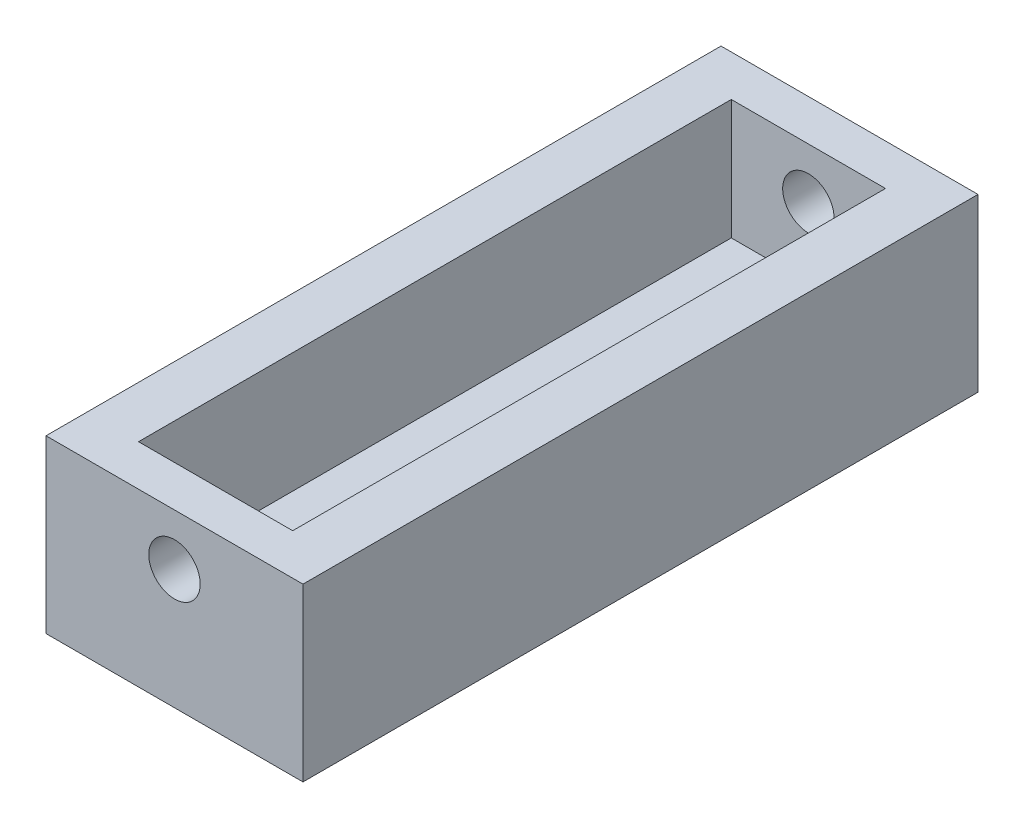
ISO-10303-21;
HEADER;
FILE_DESCRIPTION(('STEP AP214'),'2;1');
FILE_NAME('part.step','',(''),(''),'','','');
FILE_SCHEMA(('AUTOMOTIVE_DESIGN { 1 0 10303 214 1 1 1 1 }'));
ENDSEC;
DATA;
#1=APPLICATION_CONTEXT('core data for automotive mechanical design processes');
#2=APPLICATION_PROTOCOL_DEFINITION('international standard','automotive_design',2000,#1);
#3=PRODUCT_CONTEXT('',#1,'mechanical');
#4=PRODUCT('Part','Part','',(#3));
#5=PRODUCT_RELATED_PRODUCT_CATEGORY('part','',(#4));
#6=PRODUCT_DEFINITION_FORMATION('','',#4);
#7=PRODUCT_DEFINITION_CONTEXT('part definition',#1,'design');
#8=PRODUCT_DEFINITION('design','',#6,#7);
#9=PRODUCT_DEFINITION_SHAPE('','',#8);
#10=(LENGTH_UNIT() NAMED_UNIT(*) SI_UNIT(.MILLI.,.METRE.));
#11=(NAMED_UNIT(*) PLANE_ANGLE_UNIT() SI_UNIT($,.RADIAN.));
#12=(NAMED_UNIT(*) SI_UNIT($,.STERADIAN.) SOLID_ANGLE_UNIT());
#13=UNCERTAINTY_MEASURE_WITH_UNIT(LENGTH_MEASURE(1.E-05),#10,'distance_accuracy_value','');
#14=(GEOMETRIC_REPRESENTATION_CONTEXT(3) GLOBAL_UNCERTAINTY_ASSIGNED_CONTEXT((#13)) GLOBAL_UNIT_ASSIGNED_CONTEXT((#10,
#11,#12)) REPRESENTATION_CONTEXT('',''));
#15=CARTESIAN_POINT('',(0.,0.,0.));
#16=DIRECTION('',(0.,0.,1.));
#17=DIRECTION('',(1.,0.,0.));
#18=AXIS2_PLACEMENT_3D('',#15,#16,#17);
#19=CARTESIAN_POINT('',(0.,0.,0.));
#20=DIRECTION('',(0.,0.,1.));
#21=DIRECTION('',(1.,0.,0.));
#22=AXIS2_PLACEMENT_3D('',#19,#20,#21);
#23=PLANE('',#22);
#24=CARTESIAN_POINT('',(0.,3.5,0.));
#25=DIRECTION('',(0.,0.,1.));
#26=DIRECTION('',(1.,0.,0.));
#27=AXIS2_PLACEMENT_3D('',#24,#25,#26);
#28=CIRCLE('',#27,0.75);
#29=CARTESIAN_POINT('',(0.75,3.5,0.));
#30=VERTEX_POINT('',#29);
#31=EDGE_CURVE('E170',#30,#30,#28,.T.);
#32=ORIENTED_EDGE('',*,*,#31,.F.);
#33=EDGE_LOOP('',(#32));
#34=FACE_BOUND('',#33,.T.);
#35=DIRECTION('',(-1.,0.,0.));
#36=VECTOR('',#35,1.);
#37=CARTESIAN_POINT('',(-2.25,1.5,0.));
#38=LINE('',#37,#36);
#39=CARTESIAN_POINT('',(-0.6,1.5,0.));
#40=VERTEX_POINT('',#39);
#41=CARTESIAN_POINT('',(-2.25,1.5,0.));
#42=VERTEX_POINT('',#41);
#43=EDGE_CURVE('E190',#40,#42,#38,.T.);
#44=ORIENTED_EDGE('',*,*,#43,.F.);
#45=DIRECTION('',(0.,1.,0.));
#46=VECTOR('',#45,1.);
#47=CARTESIAN_POINT('',(-0.6,1.5,0.));
#48=LINE('',#47,#46);
#49=CARTESIAN_POINT('',(-0.6,0.,0.));
#50=VERTEX_POINT('',#49);
#51=EDGE_CURVE('E175',#50,#40,#48,.T.);
#52=ORIENTED_EDGE('',*,*,#51,.F.);
#53=DIRECTION('',(-1.,0.,0.));
#54=VECTOR('',#53,1.);
#55=CARTESIAN_POINT('',(0.,0.,0.));
#56=LINE('',#55,#54);
#57=CARTESIAN_POINT('',(0.6,0.,0.));
#58=VERTEX_POINT('',#57);
#59=EDGE_CURVE('E203',#58,#50,#56,.T.);
#60=ORIENTED_EDGE('',*,*,#59,.F.);
#61=DIRECTION('',(0.,-1.,0.));
#62=VECTOR('',#61,1.);
#63=CARTESIAN_POINT('',(0.6,1.5,0.));
#64=LINE('',#63,#62);
#65=CARTESIAN_POINT('',(0.6,1.5,0.));
#66=VERTEX_POINT('',#65);
#67=EDGE_CURVE('E222',#66,#58,#64,.T.);
#68=ORIENTED_EDGE('',*,*,#67,.F.);
#69=DIRECTION('',(-1.,0.,0.));
#70=VECTOR('',#69,1.);
#71=CARTESIAN_POINT('',(2.25,1.5,0.));
#72=LINE('',#71,#70);
#73=CARTESIAN_POINT('',(2.25,1.5,0.));
#74=VERTEX_POINT('',#73);
#75=EDGE_CURVE('E227',#74,#66,#72,.T.);
#76=ORIENTED_EDGE('',*,*,#75,.F.);
#77=DIRECTION('',(0.,-1.,0.));
#78=VECTOR('',#77,1.);
#79=CARTESIAN_POINT('',(2.25,5.,0.));
#80=LINE('',#79,#78);
#81=CARTESIAN_POINT('',(2.25,5.,0.));
#82=VERTEX_POINT('',#81);
#83=EDGE_CURVE('E230',#82,#74,#80,.T.);
#84=ORIENTED_EDGE('',*,*,#83,.F.);
#85=DIRECTION('',(1.,0.,0.));
#86=VECTOR('',#85,1.);
#87=CARTESIAN_POINT('',(0.,5.,0.));
#88=LINE('',#87,#86);
#89=CARTESIAN_POINT('',(-2.25,5.,0.));
#90=VERTEX_POINT('',#89);
#91=EDGE_CURVE('E54',#90,#82,#88,.T.);
#92=ORIENTED_EDGE('',*,*,#91,.F.);
#93=DIRECTION('',(0.,1.,0.));
#94=VECTOR('',#93,1.);
#95=CARTESIAN_POINT('',(-2.25,1.5,0.));
#96=LINE('',#95,#94);
#97=EDGE_CURVE('E182',#42,#90,#96,.T.);
#98=ORIENTED_EDGE('',*,*,#97,.F.);
#99=EDGE_LOOP('',(#44,#52,#60,#68,#76,#84,#92,#98));
#100=FACE_BOUND('',#99,.T.);
#101=ADVANCED_FACE('F50',(#34,#100),#23,.T.);
#102=CARTESIAN_POINT('',(0.6,0.,17.3));
#103=DIRECTION('',(0.,1.,0.));
#104=DIRECTION('',(0.,0.,1.));
#105=AXIS2_PLACEMENT_3D('',#102,#103,#104);
#106=PLANE('',#105);
#107=DIRECTION('',(0.,0.,-1.));
#108=VECTOR('',#107,1.);
#109=CARTESIAN_POINT('',(3.75,0.,17.3));
#110=LINE('',#109,#108);
#111=CARTESIAN_POINT('',(3.75,0.,18.5));
#112=VERTEX_POINT('',#111);
#113=CARTESIAN_POINT('',(3.75,0.,-1.2));
#114=VERTEX_POINT('',#113);
#115=EDGE_CURVE('E13',#112,#114,#110,.T.);
#116=ORIENTED_EDGE('',*,*,#115,.F.);
#117=DIRECTION('',(1.,0.,0.));
#118=VECTOR('',#117,1.);
#119=CARTESIAN_POINT('',(3.75,0.,18.5));
#120=LINE('',#119,#118);
#121=CARTESIAN_POINT('',(-3.75,0.,18.5));
#122=VERTEX_POINT('',#121);
#123=EDGE_CURVE('E153',#122,#112,#120,.T.);
#124=ORIENTED_EDGE('',*,*,#123,.F.);
#125=DIRECTION('',(0.,0.,1.));
#126=VECTOR('',#125,1.);
#127=CARTESIAN_POINT('',(-3.75,0.,-1.2));
#128=LINE('',#127,#126);
#129=CARTESIAN_POINT('',(-3.75,0.,-1.2));
#130=VERTEX_POINT('',#129);
#131=EDGE_CURVE('E139',#130,#122,#128,.T.);
#132=ORIENTED_EDGE('',*,*,#131,.F.);
#133=DIRECTION('',(-1.,0.,0.));
#134=VECTOR('',#133,1.);
#135=CARTESIAN_POINT('',(0.,0.,-1.2));
#136=LINE('',#135,#134);
#137=EDGE_CURVE('E205',#114,#130,#136,.T.);
#138=ORIENTED_EDGE('',*,*,#137,.F.);
#139=EDGE_LOOP('',(#116,#124,#132,#138));
#140=FACE_BOUND('',#139,.T.);
#141=DIRECTION('',(0.,0.,-1.));
#142=VECTOR('',#141,1.);
#143=CARTESIAN_POINT('',(0.6,0.,17.3));
#144=LINE('',#143,#142);
#145=CARTESIAN_POINT('',(0.6,0.,17.3));
#146=VERTEX_POINT('',#145);
#147=EDGE_CURVE('E69',#146,#58,#144,.T.);
#148=ORIENTED_EDGE('',*,*,#147,.T.);
#149=ORIENTED_EDGE('',*,*,#59,.T.);
#150=DIRECTION('',(0.,0.,-1.));
#151=VECTOR('',#150,1.);
#152=CARTESIAN_POINT('',(-0.6,0.,17.3));
#153=LINE('',#152,#151);
#154=CARTESIAN_POINT('',(-0.6,0.,17.3));
#155=VERTEX_POINT('',#154);
#156=EDGE_CURVE('E201',#155,#50,#153,.T.);
#157=ORIENTED_EDGE('',*,*,#156,.F.);
#158=DIRECTION('',(1.,0.,0.));
#159=VECTOR('',#158,1.);
#160=CARTESIAN_POINT('',(3.75,0.,17.3));
#161=LINE('',#160,#159);
#162=EDGE_CURVE('E167',#155,#146,#161,.T.);
#163=ORIENTED_EDGE('',*,*,#162,.T.);
#164=EDGE_LOOP('',(#148,#149,#157,#163));
#165=FACE_BOUND('',#164,.T.);
#166=ADVANCED_FACE('F52',(#140,#165),#106,.F.);
#167=CARTESIAN_POINT('',(3.75,0.,17.3));
#168=DIRECTION('',(-1.,0.,0.));
#169=DIRECTION('',(0.,0.,1.));
#170=AXIS2_PLACEMENT_3D('',#167,#168,#169);
#171=PLANE('',#170);
#172=ORIENTED_EDGE('',*,*,#115,.T.);
#173=DIRECTION('',(0.,-1.,0.));
#174=VECTOR('',#173,1.);
#175=CARTESIAN_POINT('',(3.75,0.,-1.2));
#176=LINE('',#175,#174);
#177=CARTESIAN_POINT('',(3.75,5.,-1.2));
#178=VERTEX_POINT('',#177);
#179=EDGE_CURVE('E207',#178,#114,#176,.T.);
#180=ORIENTED_EDGE('',*,*,#179,.F.);
#181=DIRECTION('',(0.,0.,-1.));
#182=VECTOR('',#181,1.);
#183=CARTESIAN_POINT('',(3.75,5.,17.3));
#184=LINE('',#183,#182);
#185=CARTESIAN_POINT('',(3.75,5.,18.5));
#186=VERTEX_POINT('',#185);
#187=EDGE_CURVE('E61',#186,#178,#184,.T.);
#188=ORIENTED_EDGE('',*,*,#187,.F.);
#189=DIRECTION('',(0.,1.,0.));
#190=VECTOR('',#189,1.);
#191=CARTESIAN_POINT('',(3.75,5.,18.5));
#192=LINE('',#191,#190);
#193=EDGE_CURVE('E158',#112,#186,#192,.T.);
#194=ORIENTED_EDGE('',*,*,#193,.F.);
#195=EDGE_LOOP('',(#172,#180,#188,#194));
#196=FACE_BOUND('',#195,.T.);
#197=ADVANCED_FACE('F261',(#196),#171,.F.);
#198=CARTESIAN_POINT('',(3.75,5.,17.3));
#199=DIRECTION('',(0.,-1.,0.));
#200=DIRECTION('',(1.,0.,0.));
#201=AXIS2_PLACEMENT_3D('',#198,#199,#200);
#202=PLANE('',#201);
#203=DIRECTION('',(0.,0.,-1.));
#204=VECTOR('',#203,1.);
#205=CARTESIAN_POINT('',(2.25,5.,17.3));
#206=LINE('',#205,#204);
#207=CARTESIAN_POINT('',(2.25,5.,17.3));
#208=VERTEX_POINT('',#207);
#209=EDGE_CURVE('E244',#208,#82,#206,.T.);
#210=ORIENTED_EDGE('',*,*,#209,.F.);
#211=DIRECTION('',(-1.,0.,0.));
#212=VECTOR('',#211,1.);
#213=CARTESIAN_POINT('',(-3.75,5.,17.3));
#214=LINE('',#213,#212);
#215=CARTESIAN_POINT('',(-2.25,5.,17.3));
#216=VERTEX_POINT('',#215);
#217=EDGE_CURVE('E164',#208,#216,#214,.T.);
#218=ORIENTED_EDGE('',*,*,#217,.T.);
#219=DIRECTION('',(0.,0.,-1.));
#220=VECTOR('',#219,1.);
#221=CARTESIAN_POINT('',(-2.25,5.,17.3));
#222=LINE('',#221,#220);
#223=EDGE_CURVE('E188',#216,#90,#222,.T.);
#224=ORIENTED_EDGE('',*,*,#223,.T.);
#225=ORIENTED_EDGE('',*,*,#91,.T.);
#226=EDGE_LOOP('',(#210,#218,#224,#225));
#227=FACE_BOUND('',#226,.T.);
#228=ORIENTED_EDGE('',*,*,#187,.T.);
#229=DIRECTION('',(1.,0.,0.));
#230=VECTOR('',#229,1.);
#231=CARTESIAN_POINT('',(0.,5.,-1.2));
#232=LINE('',#231,#230);
#233=CARTESIAN_POINT('',(-3.75,5.,-1.2));
#234=VERTEX_POINT('',#233);
#235=EDGE_CURVE('E150',#234,#178,#232,.T.);
#236=ORIENTED_EDGE('',*,*,#235,.F.);
#237=DIRECTION('',(0.,0.,1.));
#238=VECTOR('',#237,1.);
#239=CARTESIAN_POINT('',(-3.75,5.,-1.2));
#240=LINE('',#239,#238);
#241=CARTESIAN_POINT('',(-3.75,5.,18.5));
#242=VERTEX_POINT('',#241);
#243=EDGE_CURVE('E149',#234,#242,#240,.T.);
#244=ORIENTED_EDGE('',*,*,#243,.T.);
#245=DIRECTION('',(-1.,0.,0.));
#246=VECTOR('',#245,1.);
#247=CARTESIAN_POINT('',(-3.75,5.,18.5));
#248=LINE('',#247,#246);
#249=EDGE_CURVE('E163',#186,#242,#248,.T.);
#250=ORIENTED_EDGE('',*,*,#249,.F.);
#251=EDGE_LOOP('',(#228,#236,#244,#250));
#252=FACE_BOUND('',#251,.T.);
#253=ADVANCED_FACE('F256',(#227,#252),#202,.F.);
#254=CARTESIAN_POINT('',(2.25,5.,17.3));
#255=DIRECTION('',(1.,0.,0.));
#256=DIRECTION('',(0.,0.,-1.));
#257=AXIS2_PLACEMENT_3D('',#254,#255,#256);
#258=PLANE('',#257);
#259=ORIENTED_EDGE('',*,*,#83,.T.);
#260=DIRECTION('',(0.,0.,-1.));
#261=VECTOR('',#260,1.);
#262=CARTESIAN_POINT('',(2.25,1.5,17.3));
#263=LINE('',#262,#261);
#264=CARTESIAN_POINT('',(2.25,1.5,17.3));
#265=VERTEX_POINT('',#264);
#266=EDGE_CURVE('E242',#265,#74,#263,.T.);
#267=ORIENTED_EDGE('',*,*,#266,.F.);
#268=DIRECTION('',(0.,-1.,0.));
#269=VECTOR('',#268,1.);
#270=CARTESIAN_POINT('',(2.25,5.,17.3));
#271=LINE('',#270,#269);
#272=EDGE_CURVE('E218',#208,#265,#271,.T.);
#273=ORIENTED_EDGE('',*,*,#272,.F.);
#274=ORIENTED_EDGE('',*,*,#209,.T.);
#275=EDGE_LOOP('',(#259,#267,#273,#274));
#276=FACE_BOUND('',#275,.T.);
#277=ADVANCED_FACE('F267',(#276),#258,.F.);
#278=CARTESIAN_POINT('',(2.25,1.5,17.3));
#279=DIRECTION('',(0.,-1.,0.));
#280=DIRECTION('',(1.,0.,0.));
#281=AXIS2_PLACEMENT_3D('',#278,#279,#280);
#282=PLANE('',#281);
#283=ORIENTED_EDGE('',*,*,#75,.T.);
#284=DIRECTION('',(0.,0.,-1.));
#285=VECTOR('',#284,1.);
#286=CARTESIAN_POINT('',(0.6,1.5,17.3));
#287=LINE('',#286,#285);
#288=CARTESIAN_POINT('',(0.6,1.5,17.3));
#289=VERTEX_POINT('',#288);
#290=EDGE_CURVE('E233',#289,#66,#287,.T.);
#291=ORIENTED_EDGE('',*,*,#290,.F.);
#292=DIRECTION('',(-1.,0.,0.));
#293=VECTOR('',#292,1.);
#294=CARTESIAN_POINT('',(2.25,1.5,17.3));
#295=LINE('',#294,#293);
#296=EDGE_CURVE('E221',#265,#289,#295,.T.);
#297=ORIENTED_EDGE('',*,*,#296,.F.);
#298=ORIENTED_EDGE('',*,*,#266,.T.);
#299=EDGE_LOOP('',(#283,#291,#297,#298));
#300=FACE_BOUND('',#299,.T.);
#301=ADVANCED_FACE('F285',(#300),#282,.F.);
#302=CARTESIAN_POINT('',(0.6,1.5,17.3));
#303=DIRECTION('',(1.,0.,0.));
#304=DIRECTION('',(0.,1.,0.));
#305=AXIS2_PLACEMENT_3D('',#302,#303,#304);
#306=PLANE('',#305);
#307=ORIENTED_EDGE('',*,*,#67,.T.);
#308=ORIENTED_EDGE('',*,*,#147,.F.);
#309=DIRECTION('',(0.,-1.,0.));
#310=VECTOR('',#309,1.);
#311=CARTESIAN_POINT('',(0.6,1.5,17.3));
#312=LINE('',#311,#310);
#313=EDGE_CURVE('E225',#289,#146,#312,.T.);
#314=ORIENTED_EDGE('',*,*,#313,.F.);
#315=ORIENTED_EDGE('',*,*,#290,.T.);
#316=EDGE_LOOP('',(#307,#308,#314,#315));
#317=FACE_BOUND('',#316,.T.);
#318=ADVANCED_FACE('F282',(#317),#306,.F.);
#319=CARTESIAN_POINT('',(-3.75,0.,-1.2));
#320=DIRECTION('',(1.,0.,0.));
#321=DIRECTION('',(0.,0.,-1.));
#322=AXIS2_PLACEMENT_3D('',#319,#320,#321);
#323=PLANE('',#322);
#324=ORIENTED_EDGE('',*,*,#131,.T.);
#325=DIRECTION('',(0.,-1.,0.));
#326=VECTOR('',#325,1.);
#327=CARTESIAN_POINT('',(-3.75,0.,18.5));
#328=LINE('',#327,#326);
#329=EDGE_CURVE('E144',#242,#122,#328,.T.);
#330=ORIENTED_EDGE('',*,*,#329,.F.);
#331=ORIENTED_EDGE('',*,*,#243,.F.);
#332=DIRECTION('',(0.,1.,0.));
#333=VECTOR('',#332,1.);
#334=CARTESIAN_POINT('',(-3.75,0.,-1.2));
#335=LINE('',#334,#333);
#336=EDGE_CURVE('E146',#130,#234,#335,.T.);
#337=ORIENTED_EDGE('',*,*,#336,.F.);
#338=EDGE_LOOP('',(#324,#330,#331,#337));
#339=FACE_BOUND('',#338,.T.);
#340=ADVANCED_FACE('F141',(#339),#323,.F.);
#341=CARTESIAN_POINT('',(0.,0.,-1.2));
#342=DIRECTION('',(0.,0.,1.));
#343=DIRECTION('',(1.,0.,0.));
#344=AXIS2_PLACEMENT_3D('',#341,#342,#343);
#345=PLANE('',#344);
#346=CARTESIAN_POINT('',(0.,3.5,-1.2));
#347=DIRECTION('',(0.,0.,1.));
#348=DIRECTION('',(1.,0.,0.));
#349=AXIS2_PLACEMENT_3D('',#346,#347,#348);
#350=CIRCLE('',#349,0.75);
#351=CARTESIAN_POINT('',(0.75,3.5,-1.2));
#352=VERTEX_POINT('',#351);
#353=EDGE_CURVE('E374',#352,#352,#350,.F.);
#354=ORIENTED_EDGE('',*,*,#353,.F.);
#355=EDGE_LOOP('',(#354));
#356=FACE_BOUND('',#355,.T.);
#357=ORIENTED_EDGE('',*,*,#336,.T.);
#358=ORIENTED_EDGE('',*,*,#235,.T.);
#359=ORIENTED_EDGE('',*,*,#179,.T.);
#360=ORIENTED_EDGE('',*,*,#137,.T.);
#361=EDGE_LOOP('',(#357,#358,#359,#360));
#362=FACE_BOUND('',#361,.T.);
#363=ADVANCED_FACE('F259',(#356,#362),#345,.F.);
#364=CARTESIAN_POINT('',(-0.6,1.5,17.3));
#365=DIRECTION('',(-1.,0.,0.));
#366=DIRECTION('',(0.,-1.,0.));
#367=AXIS2_PLACEMENT_3D('',#364,#365,#366);
#368=PLANE('',#367);
#369=ORIENTED_EDGE('',*,*,#51,.T.);
#370=DIRECTION('',(0.,0.,-1.));
#371=VECTOR('',#370,1.);
#372=CARTESIAN_POINT('',(-0.6,1.5,17.3));
#373=LINE('',#372,#371);
#374=CARTESIAN_POINT('',(-0.6,1.5,17.3));
#375=VERTEX_POINT('',#374);
#376=EDGE_CURVE('E198',#375,#40,#373,.T.);
#377=ORIENTED_EDGE('',*,*,#376,.F.);
#378=DIRECTION('',(0.,1.,0.));
#379=VECTOR('',#378,1.);
#380=CARTESIAN_POINT('',(-0.6,1.5,17.3));
#381=LINE('',#380,#379);
#382=EDGE_CURVE('E178',#155,#375,#381,.T.);
#383=ORIENTED_EDGE('',*,*,#382,.F.);
#384=ORIENTED_EDGE('',*,*,#156,.T.);
#385=EDGE_LOOP('',(#369,#377,#383,#384));
#386=FACE_BOUND('',#385,.T.);
#387=ADVANCED_FACE('F315',(#386),#368,.F.);
#388=CARTESIAN_POINT('',(-2.25,1.5,17.3));
#389=DIRECTION('',(0.,-1.,0.));
#390=DIRECTION('',(1.,0.,0.));
#391=AXIS2_PLACEMENT_3D('',#388,#389,#390);
#392=PLANE('',#391);
#393=ORIENTED_EDGE('',*,*,#43,.T.);
#394=DIRECTION('',(0.,0.,-1.));
#395=VECTOR('',#394,1.);
#396=CARTESIAN_POINT('',(-2.25,1.5,17.3));
#397=LINE('',#396,#395);
#398=CARTESIAN_POINT('',(-2.25,1.5,17.3));
#399=VERTEX_POINT('',#398);
#400=EDGE_CURVE('E195',#399,#42,#397,.T.);
#401=ORIENTED_EDGE('',*,*,#400,.F.);
#402=DIRECTION('',(-1.,0.,0.));
#403=VECTOR('',#402,1.);
#404=CARTESIAN_POINT('',(-2.25,1.5,17.3));
#405=LINE('',#404,#403);
#406=EDGE_CURVE('E181',#375,#399,#405,.T.);
#407=ORIENTED_EDGE('',*,*,#406,.F.);
#408=ORIENTED_EDGE('',*,*,#376,.T.);
#409=EDGE_LOOP('',(#393,#401,#407,#408));
#410=FACE_BOUND('',#409,.T.);
#411=ADVANCED_FACE('F322',(#410),#392,.F.);
#412=CARTESIAN_POINT('',(-2.25,1.5,17.3));
#413=DIRECTION('',(-1.,0.,0.));
#414=DIRECTION('',(0.,0.,1.));
#415=AXIS2_PLACEMENT_3D('',#412,#413,#414);
#416=PLANE('',#415);
#417=ORIENTED_EDGE('',*,*,#97,.T.);
#418=ORIENTED_EDGE('',*,*,#223,.F.);
#419=DIRECTION('',(0.,1.,0.));
#420=VECTOR('',#419,1.);
#421=CARTESIAN_POINT('',(-2.25,1.5,17.3));
#422=LINE('',#421,#420);
#423=EDGE_CURVE('E185',#399,#216,#422,.T.);
#424=ORIENTED_EDGE('',*,*,#423,.F.);
#425=ORIENTED_EDGE('',*,*,#400,.T.);
#426=EDGE_LOOP('',(#417,#418,#424,#425));
#427=FACE_BOUND('',#426,.T.);
#428=ADVANCED_FACE('F329',(#427),#416,.F.);
#429=CARTESIAN_POINT('',(0.,0.,17.3));
#430=DIRECTION('',(0.,0.,-1.));
#431=DIRECTION('',(-1.,0.,0.));
#432=AXIS2_PLACEMENT_3D('',#429,#430,#431);
#433=PLANE('',#432);
#434=CARTESIAN_POINT('',(0.,3.5,17.3));
#435=DIRECTION('',(0.,0.,-1.));
#436=DIRECTION('',(-1.,0.,0.));
#437=AXIS2_PLACEMENT_3D('',#434,#435,#436);
#438=CIRCLE('',#437,0.75);
#439=CARTESIAN_POINT('',(-0.75,3.5,17.3));
#440=VERTEX_POINT('',#439);
#441=EDGE_CURVE('E375',#440,#440,#438,.T.);
#442=ORIENTED_EDGE('',*,*,#441,.F.);
#443=EDGE_LOOP('',(#442));
#444=FACE_BOUND('',#443,.T.);
#445=ORIENTED_EDGE('',*,*,#272,.T.);
#446=ORIENTED_EDGE('',*,*,#296,.T.);
#447=ORIENTED_EDGE('',*,*,#313,.T.);
#448=ORIENTED_EDGE('',*,*,#162,.F.);
#449=ORIENTED_EDGE('',*,*,#382,.T.);
#450=ORIENTED_EDGE('',*,*,#406,.T.);
#451=ORIENTED_EDGE('',*,*,#423,.T.);
#452=ORIENTED_EDGE('',*,*,#217,.F.);
#453=EDGE_LOOP('',(#445,#446,#447,#448,#449,#450,#451,#452));
#454=FACE_BOUND('',#453,.T.);
#455=ADVANCED_FACE('F337',(#444,#454),#433,.T.);
#456=CARTESIAN_POINT('',(0.,0.,18.5));
#457=DIRECTION('',(0.,0.,-1.));
#458=DIRECTION('',(-1.,0.,0.));
#459=AXIS2_PLACEMENT_3D('',#456,#457,#458);
#460=PLANE('',#459);
#461=CARTESIAN_POINT('',(0.,3.5,18.5));
#462=DIRECTION('',(0.,0.,1.));
#463=DIRECTION('',(1.,0.,0.));
#464=AXIS2_PLACEMENT_3D('',#461,#462,#463);
#465=CIRCLE('',#464,0.75);
#466=CARTESIAN_POINT('',(0.75,3.5,18.5));
#467=VERTEX_POINT('',#466);
#468=EDGE_CURVE('E376',#467,#467,#465,.T.);
#469=ORIENTED_EDGE('',*,*,#468,.F.);
#470=EDGE_LOOP('',(#469));
#471=FACE_BOUND('',#470,.T.);
#472=ORIENTED_EDGE('',*,*,#329,.T.);
#473=ORIENTED_EDGE('',*,*,#123,.T.);
#474=ORIENTED_EDGE('',*,*,#193,.T.);
#475=ORIENTED_EDGE('',*,*,#249,.T.);
#476=EDGE_LOOP('',(#472,#473,#474,#475));
#477=FACE_BOUND('',#476,.T.);
#478=ADVANCED_FACE('F161',(#471,#477),#460,.F.);
#479=CARTESIAN_POINT('',(0.,3.5,-3.32132034355964));
#480=DIRECTION('',(0.,0.,1.));
#481=DIRECTION('',(1.,0.,0.));
#482=AXIS2_PLACEMENT_3D('',#479,#480,#481);
#483=CYLINDRICAL_SURFACE('',#482,0.75);
#484=ORIENTED_EDGE('',*,*,#441,.T.);
#485=EDGE_LOOP('',(#484));
#486=FACE_BOUND('',#485,.T.);
#487=ORIENTED_EDGE('',*,*,#468,.T.);
#488=EDGE_LOOP('',(#487));
#489=FACE_BOUND('',#488,.T.);
#490=ADVANCED_FACE('F352',(#486,#489),#483,.F.);
#491=ORIENTED_EDGE('',*,*,#31,.T.);
#492=EDGE_LOOP('',(#491));
#493=FACE_BOUND('',#492,.T.);
#494=ORIENTED_EDGE('',*,*,#353,.T.);
#495=EDGE_LOOP('',(#494));
#496=FACE_BOUND('',#495,.T.);
#497=ADVANCED_FACE('F360',(#493,#496),#483,.F.);
#498=CLOSED_SHELL('',(#101,#166,#197,#253,#277,#301,#318,#340,#363,#387,#411,#428,#455,#478,
#490,#497));
#499=MANIFOLD_SOLID_BREP('B2',#498);
#500=ADVANCED_BREP_SHAPE_REPRESENTATION('',(#18,#499),#14);
#501=SHAPE_DEFINITION_REPRESENTATION(#9,#500);
ENDSEC;
END-ISO-10303-21;
